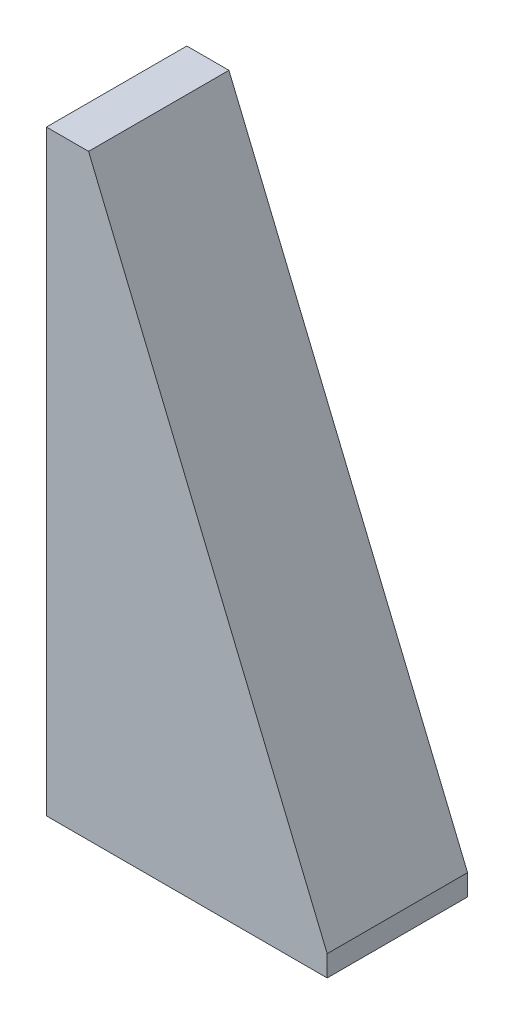
ISO-10303-21;
HEADER;
FILE_DESCRIPTION(('STEP AP214'),'2;1');
FILE_NAME('part.step','',(''),(''),'','','');
FILE_SCHEMA(('AUTOMOTIVE_DESIGN { 1 0 10303 214 1 1 1 1 }'));
ENDSEC;
DATA;
#1=APPLICATION_CONTEXT('core data for automotive mechanical design processes');
#2=APPLICATION_PROTOCOL_DEFINITION('international standard','automotive_design',2000,#1);
#3=PRODUCT_CONTEXT('',#1,'mechanical');
#4=PRODUCT('Part','Part','',(#3));
#5=PRODUCT_RELATED_PRODUCT_CATEGORY('part','',(#4));
#6=PRODUCT_DEFINITION_FORMATION('','',#4);
#7=PRODUCT_DEFINITION_CONTEXT('part definition',#1,'design');
#8=PRODUCT_DEFINITION('design','',#6,#7);
#9=PRODUCT_DEFINITION_SHAPE('','',#8);
#10=(LENGTH_UNIT() NAMED_UNIT(*) SI_UNIT(.MILLI.,.METRE.));
#11=(NAMED_UNIT(*) PLANE_ANGLE_UNIT() SI_UNIT($,.RADIAN.));
#12=(NAMED_UNIT(*) SI_UNIT($,.STERADIAN.) SOLID_ANGLE_UNIT());
#13=UNCERTAINTY_MEASURE_WITH_UNIT(LENGTH_MEASURE(1.E-05),#10,'distance_accuracy_value','');
#14=(GEOMETRIC_REPRESENTATION_CONTEXT(3) GLOBAL_UNCERTAINTY_ASSIGNED_CONTEXT((#13)) GLOBAL_UNIT_ASSIGNED_CONTEXT((#10,
#11,#12)) REPRESENTATION_CONTEXT('',''));
#15=CARTESIAN_POINT('',(0.,0.,0.));
#16=DIRECTION('',(0.,0.,1.));
#17=DIRECTION('',(1.,0.,0.));
#18=AXIS2_PLACEMENT_3D('',#15,#16,#17);
#19=CARTESIAN_POINT('',(3.,41.,10.));
#20=DIRECTION('',(-0.923742113571632,-0.383015022700433,0.));
#21=DIRECTION('',(0.383015022700433,-0.923742113571632,0.));
#22=AXIS2_PLACEMENT_3D('',#19,#20,#21);
#23=PLANE('',#22);
#24=DIRECTION('',(-0.383015022700433,0.923742113571632,0.));
#25=VECTOR('',#24,1.);
#26=CARTESIAN_POINT('',(3.,41.,0.));
#27=LINE('',#26,#25);
#28=CARTESIAN_POINT('',(20.,0.,0.));
#29=VERTEX_POINT('',#28);
#30=CARTESIAN_POINT('',(3.,41.,0.));
#31=VERTEX_POINT('',#30);
#32=EDGE_CURVE('E69',#29,#31,#27,.T.);
#33=ORIENTED_EDGE('',*,*,#32,.T.);
#34=DIRECTION('',(0.,0.,-1.));
#35=VECTOR('',#34,1.);
#36=CARTESIAN_POINT('',(3.,41.,10.));
#37=LINE('',#36,#35);
#38=CARTESIAN_POINT('',(3.,41.,10.));
#39=VERTEX_POINT('',#38);
#40=EDGE_CURVE('E48',#39,#31,#37,.T.);
#41=ORIENTED_EDGE('',*,*,#40,.F.);
#42=DIRECTION('',(-0.383015022700433,0.923742113571632,0.));
#43=VECTOR('',#42,1.);
#44=CARTESIAN_POINT('',(3.,41.,10.));
#45=LINE('',#44,#43);
#46=CARTESIAN_POINT('',(20.,0.,10.));
#47=VERTEX_POINT('',#46);
#48=EDGE_CURVE('E77',#47,#39,#45,.T.);
#49=ORIENTED_EDGE('',*,*,#48,.F.);
#50=DIRECTION('',(0.,0.,-1.));
#51=VECTOR('',#50,1.);
#52=CARTESIAN_POINT('',(20.,0.,10.));
#53=LINE('',#52,#51);
#54=EDGE_CURVE('E11',#47,#29,#53,.T.);
#55=ORIENTED_EDGE('',*,*,#54,.T.);
#56=EDGE_LOOP('',(#33,#41,#49,#55));
#57=FACE_BOUND('',#56,.T.);
#58=ADVANCED_FACE('F39',(#57),#23,.F.);
#59=CARTESIAN_POINT('',(0.,41.,10.));
#60=DIRECTION('',(0.,-1.,0.));
#61=DIRECTION('',(0.,0.,-1.));
#62=AXIS2_PLACEMENT_3D('',#59,#60,#61);
#63=PLANE('',#62);
#64=DIRECTION('',(-1.,0.,0.));
#65=VECTOR('',#64,1.);
#66=CARTESIAN_POINT('',(0.,41.,0.));
#67=LINE('',#66,#65);
#68=CARTESIAN_POINT('',(0.,41.,0.));
#69=VERTEX_POINT('',#68);
#70=EDGE_CURVE('E74',#31,#69,#67,.T.);
#71=ORIENTED_EDGE('',*,*,#70,.T.);
#72=DIRECTION('',(0.,0.,-1.));
#73=VECTOR('',#72,1.);
#74=CARTESIAN_POINT('',(0.,41.,10.));
#75=LINE('',#74,#73);
#76=CARTESIAN_POINT('',(0.,41.,10.));
#77=VERTEX_POINT('',#76);
#78=EDGE_CURVE('E132',#77,#69,#75,.T.);
#79=ORIENTED_EDGE('',*,*,#78,.F.);
#80=DIRECTION('',(-1.,0.,0.));
#81=VECTOR('',#80,1.);
#82=CARTESIAN_POINT('',(0.,41.,10.));
#83=LINE('',#82,#81);
#84=EDGE_CURVE('E56',#39,#77,#83,.T.);
#85=ORIENTED_EDGE('',*,*,#84,.F.);
#86=ORIENTED_EDGE('',*,*,#40,.T.);
#87=EDGE_LOOP('',(#71,#79,#85,#86));
#88=FACE_BOUND('',#87,.T.);
#89=ADVANCED_FACE('F141',(#88),#63,.F.);
#90=CARTESIAN_POINT('',(0.,0.,10.));
#91=DIRECTION('',(1.,0.,0.));
#92=DIRECTION('',(0.,0.,-1.));
#93=AXIS2_PLACEMENT_3D('',#90,#91,#92);
#94=PLANE('',#93);
#95=DIRECTION('',(0.,-1.,0.));
#96=VECTOR('',#95,1.);
#97=CARTESIAN_POINT('',(0.,0.,0.));
#98=LINE('',#97,#96);
#99=CARTESIAN_POINT('',(0.,-1.5,0.));
#100=VERTEX_POINT('',#99);
#101=EDGE_CURVE('E126',#69,#100,#98,.T.);
#102=ORIENTED_EDGE('',*,*,#101,.T.);
#103=DIRECTION('',(0.,0.,1.));
#104=VECTOR('',#103,1.);
#105=CARTESIAN_POINT('',(0.,-1.5,-20.0561711201316));
#106=LINE('',#105,#104);
#107=CARTESIAN_POINT('',(0.,-1.5,10.));
#108=VERTEX_POINT('',#107);
#109=EDGE_CURVE('E101',#100,#108,#106,.T.);
#110=ORIENTED_EDGE('',*,*,#109,.T.);
#111=DIRECTION('',(0.,-1.,0.));
#112=VECTOR('',#111,1.);
#113=CARTESIAN_POINT('',(0.,0.,10.));
#114=LINE('',#113,#112);
#115=EDGE_CURVE('E129',#77,#108,#114,.T.);
#116=ORIENTED_EDGE('',*,*,#115,.F.);
#117=ORIENTED_EDGE('',*,*,#78,.T.);
#118=EDGE_LOOP('',(#102,#110,#116,#117));
#119=FACE_BOUND('',#118,.T.);
#120=ADVANCED_FACE('F143',(#119),#94,.F.);
#121=CARTESIAN_POINT('',(0.,0.,10.));
#122=DIRECTION('',(0.,0.,-1.));
#123=DIRECTION('',(-1.,0.,0.));
#124=AXIS2_PLACEMENT_3D('',#121,#122,#123);
#125=PLANE('',#124);
#126=ORIENTED_EDGE('',*,*,#115,.T.);
#127=DIRECTION('',(1.,0.,0.));
#128=VECTOR('',#127,1.);
#129=CARTESIAN_POINT('',(20.,-1.5,10.));
#130=LINE('',#129,#128);
#131=CARTESIAN_POINT('',(20.,-1.5,10.));
#132=VERTEX_POINT('',#131);
#133=EDGE_CURVE('E118',#108,#132,#130,.T.);
#134=ORIENTED_EDGE('',*,*,#133,.T.);
#135=DIRECTION('',(0.,1.,0.));
#136=VECTOR('',#135,1.);
#137=CARTESIAN_POINT('',(20.,0.,10.));
#138=LINE('',#137,#136);
#139=EDGE_CURVE('E107',#132,#47,#138,.T.);
#140=ORIENTED_EDGE('',*,*,#139,.T.);
#141=ORIENTED_EDGE('',*,*,#48,.T.);
#142=ORIENTED_EDGE('',*,*,#84,.T.);
#143=EDGE_LOOP('',(#126,#134,#140,#141,#142));
#144=FACE_BOUND('',#143,.T.);
#145=ADVANCED_FACE('F145',(#144),#125,.F.);
#146=CARTESIAN_POINT('',(0.,0.,0.));
#147=DIRECTION('',(0.,0.,-1.));
#148=DIRECTION('',(-1.,0.,0.));
#149=AXIS2_PLACEMENT_3D('',#146,#147,#148);
#150=PLANE('',#149);
#151=ORIENTED_EDGE('',*,*,#32,.F.);
#152=DIRECTION('',(0.,1.,0.));
#153=VECTOR('',#152,1.);
#154=CARTESIAN_POINT('',(20.,0.,0.));
#155=LINE('',#154,#153);
#156=CARTESIAN_POINT('',(20.,-1.5,0.));
#157=VERTEX_POINT('',#156);
#158=EDGE_CURVE('E92',#157,#29,#155,.T.);
#159=ORIENTED_EDGE('',*,*,#158,.F.);
#160=DIRECTION('',(1.,0.,0.));
#161=VECTOR('',#160,1.);
#162=CARTESIAN_POINT('',(20.,-1.5,0.));
#163=LINE('',#162,#161);
#164=EDGE_CURVE('E97',#100,#157,#163,.T.);
#165=ORIENTED_EDGE('',*,*,#164,.F.);
#166=ORIENTED_EDGE('',*,*,#101,.F.);
#167=ORIENTED_EDGE('',*,*,#70,.F.);
#168=EDGE_LOOP('',(#151,#159,#165,#166,#167));
#169=FACE_BOUND('',#168,.T.);
#170=ADVANCED_FACE('F94',(#169),#150,.T.);
#171=CARTESIAN_POINT('',(20.,-1.5,-20.0561711201316));
#172=DIRECTION('',(0.,-1.,0.));
#173=DIRECTION('',(1.,0.,0.));
#174=AXIS2_PLACEMENT_3D('',#171,#172,#173);
#175=PLANE('',#174);
#176=ORIENTED_EDGE('',*,*,#109,.F.);
#177=ORIENTED_EDGE('',*,*,#164,.T.);
#178=DIRECTION('',(0.,0.,1.));
#179=VECTOR('',#178,1.);
#180=CARTESIAN_POINT('',(20.,-1.5,-20.0561711201316));
#181=LINE('',#180,#179);
#182=EDGE_CURVE('E102',#157,#132,#181,.T.);
#183=ORIENTED_EDGE('',*,*,#182,.T.);
#184=ORIENTED_EDGE('',*,*,#133,.F.);
#185=EDGE_LOOP('',(#176,#177,#183,#184));
#186=FACE_BOUND('',#185,.T.);
#187=ADVANCED_FACE('F113',(#186),#175,.T.);
#188=CARTESIAN_POINT('',(20.,0.,-20.0561711201316));
#189=DIRECTION('',(1.,0.,0.));
#190=DIRECTION('',(0.,0.,-1.));
#191=AXIS2_PLACEMENT_3D('',#188,#189,#190);
#192=PLANE('',#191);
#193=ORIENTED_EDGE('',*,*,#182,.F.);
#194=ORIENTED_EDGE('',*,*,#158,.T.);
#195=ORIENTED_EDGE('',*,*,#54,.F.);
#196=ORIENTED_EDGE('',*,*,#139,.F.);
#197=EDGE_LOOP('',(#193,#194,#195,#196));
#198=FACE_BOUND('',#197,.T.);
#199=ADVANCED_FACE('F105',(#198),#192,.T.);
#200=CLOSED_SHELL('',(#58,#89,#120,#145,#170,#187,#199));
#201=MANIFOLD_SOLID_BREP('B2',#200);
#202=ADVANCED_BREP_SHAPE_REPRESENTATION('',(#18,#201),#14);
#203=SHAPE_DEFINITION_REPRESENTATION(#9,#202);
ENDSEC;
END-ISO-10303-21;
